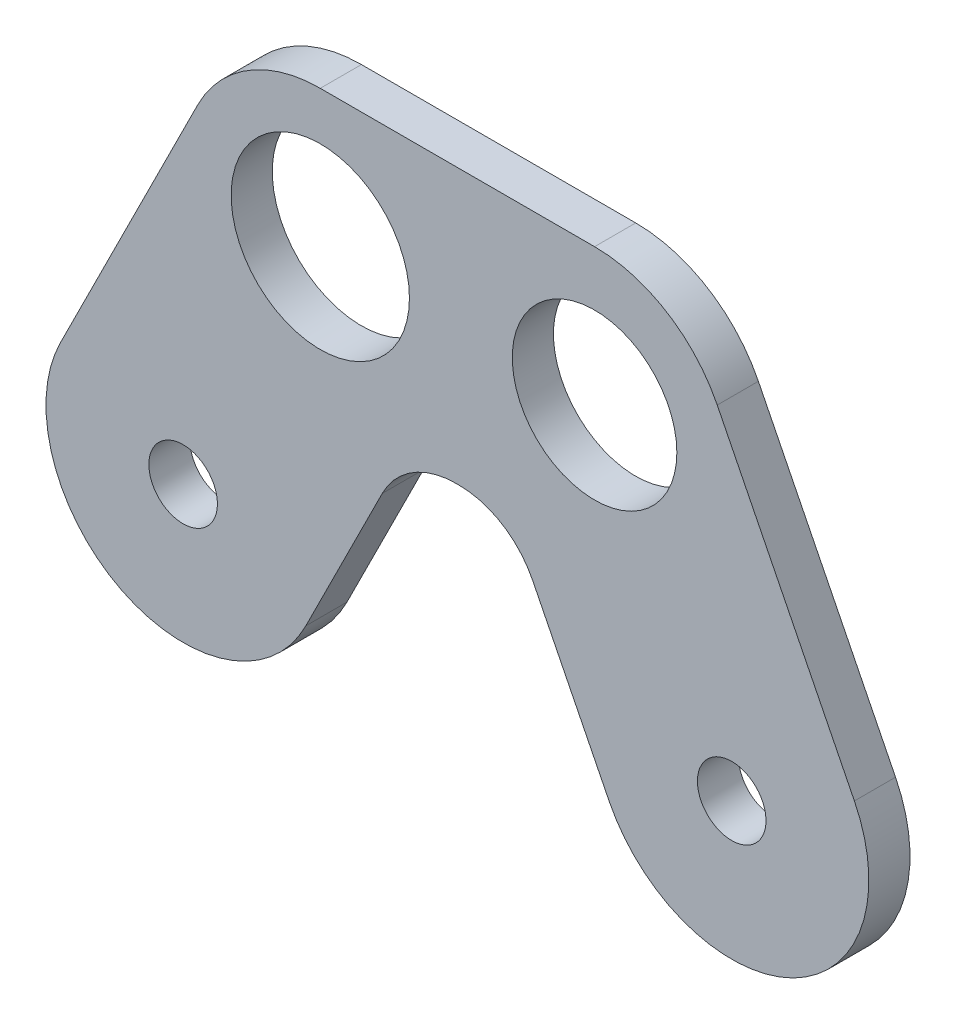
ISO-10303-21;
HEADER;
FILE_DESCRIPTION(('STEP AP214'),'2;1');
FILE_NAME('part.step','',(''),(''),'','','');
FILE_SCHEMA(('AUTOMOTIVE_DESIGN { 1 0 10303 214 1 1 1 1 }'));
ENDSEC;
DATA;
#1=APPLICATION_CONTEXT('core data for automotive mechanical design processes');
#2=APPLICATION_PROTOCOL_DEFINITION('international standard','automotive_design',2000,#1);
#3=PRODUCT_CONTEXT('',#1,'mechanical');
#4=PRODUCT('Part','Part','',(#3));
#5=PRODUCT_RELATED_PRODUCT_CATEGORY('part','',(#4));
#6=PRODUCT_DEFINITION_FORMATION('','',#4);
#7=PRODUCT_DEFINITION_CONTEXT('part definition',#1,'design');
#8=PRODUCT_DEFINITION('design','',#6,#7);
#9=PRODUCT_DEFINITION_SHAPE('','',#8);
#10=(LENGTH_UNIT() NAMED_UNIT(*) SI_UNIT(.MILLI.,.METRE.));
#11=(NAMED_UNIT(*) PLANE_ANGLE_UNIT() SI_UNIT($,.RADIAN.));
#12=(NAMED_UNIT(*) SI_UNIT($,.STERADIAN.) SOLID_ANGLE_UNIT());
#13=UNCERTAINTY_MEASURE_WITH_UNIT(LENGTH_MEASURE(1.E-05),#10,'distance_accuracy_value','');
#14=(GEOMETRIC_REPRESENTATION_CONTEXT(3) GLOBAL_UNCERTAINTY_ASSIGNED_CONTEXT((#13)) GLOBAL_UNIT_ASSIGNED_CONTEXT((#10,
#11,#12)) REPRESENTATION_CONTEXT('',''));
#15=CARTESIAN_POINT('',(0.,0.,0.));
#16=DIRECTION('',(0.,0.,1.));
#17=DIRECTION('',(1.,0.,0.));
#18=AXIS2_PLACEMENT_3D('',#15,#16,#17);
#19=CARTESIAN_POINT('',(30.,-20.,3.));
#20=DIRECTION('',(0.,0.,1.));
#21=DIRECTION('',(1.,0.,0.));
#22=AXIS2_PLACEMENT_3D('',#19,#20,#21);
#23=PLANE('',#22);
#24=CARTESIAN_POINT('',(-10.,-20.,3.));
#25=DIRECTION('',(0.,0.,1.));
#26=DIRECTION('',(1.,0.,0.));
#27=AXIS2_PLACEMENT_3D('',#24,#25,#26);
#28=CIRCLE('',#27,2.5);
#29=CARTESIAN_POINT('',(-7.5,-20.,3.));
#30=VERTEX_POINT('',#29);
#31=EDGE_CURVE('E433',#30,#30,#28,.T.);
#32=ORIENTED_EDGE('',*,*,#31,.F.);
#33=EDGE_LOOP('',(#32));
#34=FACE_BOUND('',#33,.T.);
#35=CARTESIAN_POINT('',(0.,0.,3.));
#36=DIRECTION('',(0.,0.,1.));
#37=DIRECTION('',(1.,0.,0.));
#38=AXIS2_PLACEMENT_3D('',#35,#36,#37);
#39=CIRCLE('',#38,6.5);
#40=CARTESIAN_POINT('',(6.5,0.,3.));
#41=VERTEX_POINT('',#40);
#42=EDGE_CURVE('E187',#41,#41,#39,.T.);
#43=ORIENTED_EDGE('',*,*,#42,.F.);
#44=EDGE_LOOP('',(#43));
#45=FACE_BOUND('',#44,.T.);
#46=DIRECTION('',(0.447213595499958,0.894427190999916,0.));
#47=VECTOR('',#46,1.);
#48=CARTESIAN_POINT('',(-1.05572809000083,-24.4721359549996,3.));
#49=LINE('',#48,#47);
#50=CARTESIAN_POINT('',(-1.05572809000083,-24.4721359549996,3.));
#51=VERTEX_POINT('',#50);
#52=CARTESIAN_POINT('',(4.52198067399882,-13.3167184270003,3.));
#53=VERTEX_POINT('',#52);
#54=EDGE_CURVE('E179',#51,#53,#49,.T.);
#55=ORIENTED_EDGE('',*,*,#54,.T.);
#56=CARTESIAN_POINT('',(9.88854381999832,-16.,3.));
#57=DIRECTION('',(0.,0.,1.));
#58=DIRECTION('',(1.,0.,0.));
#59=AXIS2_PLACEMENT_3D('',#56,#57,#58);
#60=CIRCLE('',#59,6.);
#61=CARTESIAN_POINT('',(9.88854381999831,-10.,3.));
#62=VERTEX_POINT('',#61);
#63=EDGE_CURVE('E11',#53,#62,#60,.F.);
#64=ORIENTED_EDGE('',*,*,#63,.T.);
#65=DIRECTION('',(1.,0.,0.));
#66=VECTOR('',#65,1.);
#67=CARTESIAN_POINT('',(6.18033988749895,-10.,3.));
#68=LINE('',#67,#66);
#69=CARTESIAN_POINT('',(10.1114561800017,-10.,3.));
#70=VERTEX_POINT('',#69);
#71=EDGE_CURVE('E141',#62,#70,#68,.T.);
#72=ORIENTED_EDGE('',*,*,#71,.T.);
#73=CARTESIAN_POINT('',(10.1114561800017,-16.,3.));
#74=DIRECTION('',(0.,0.,1.));
#75=DIRECTION('',(1.,0.,0.));
#76=AXIS2_PLACEMENT_3D('',#73,#74,#75);
#77=CIRCLE('',#76,6.);
#78=CARTESIAN_POINT('',(15.4780193260012,-13.3167184270003,3.));
#79=VERTEX_POINT('',#78);
#80=EDGE_CURVE('E136',#70,#79,#77,.F.);
#81=ORIENTED_EDGE('',*,*,#80,.T.);
#82=DIRECTION('',(0.447213595499958,-0.894427190999916,0.));
#83=VECTOR('',#82,1.);
#84=CARTESIAN_POINT('',(21.0557280900008,-24.4721359549996,3.));
#85=LINE('',#84,#83);
#86=CARTESIAN_POINT('',(21.0557280900008,-24.4721359549996,3.));
#87=VERTEX_POINT('',#86);
#88=EDGE_CURVE('E128',#79,#87,#85,.T.);
#89=ORIENTED_EDGE('',*,*,#88,.T.);
#90=CARTESIAN_POINT('',(30.,-20.,3.));
#91=DIRECTION('',(0.,0.,1.));
#92=DIRECTION('',(1.,0.,0.));
#93=AXIS2_PLACEMENT_3D('',#90,#91,#92);
#94=CIRCLE('',#93,10.);
#95=CARTESIAN_POINT('',(38.9442719099992,-15.5278640450004,3.));
#96=VERTEX_POINT('',#95);
#97=EDGE_CURVE('E132',#87,#96,#94,.T.);
#98=ORIENTED_EDGE('',*,*,#97,.T.);
#99=DIRECTION('',(-0.447213595499958,0.894427190999916,0.));
#100=VECTOR('',#99,1.);
#101=CARTESIAN_POINT('',(28.9442719099992,4.47213595499958,3.));
#102=LINE('',#101,#100);
#103=CARTESIAN_POINT('',(28.9442719099992,4.47213595499958,3.));
#104=VERTEX_POINT('',#103);
#105=EDGE_CURVE('E158',#96,#104,#102,.T.);
#106=ORIENTED_EDGE('',*,*,#105,.T.);
#107=CARTESIAN_POINT('',(20.,0.,3.));
#108=DIRECTION('',(0.,0.,1.));
#109=DIRECTION('',(1.,0.,0.));
#110=AXIS2_PLACEMENT_3D('',#107,#108,#109);
#111=CIRCLE('',#110,10.);
#112=CARTESIAN_POINT('',(20.,10.,3.));
#113=VERTEX_POINT('',#112);
#114=EDGE_CURVE('E161',#104,#113,#111,.T.);
#115=ORIENTED_EDGE('',*,*,#114,.T.);
#116=DIRECTION('',(-1.,0.,0.));
#117=VECTOR('',#116,1.);
#118=CARTESIAN_POINT('',(0.,10.,3.));
#119=LINE('',#118,#117);
#120=CARTESIAN_POINT('',(0.,10.,3.));
#121=VERTEX_POINT('',#120);
#122=EDGE_CURVE('E167',#113,#121,#119,.T.);
#123=ORIENTED_EDGE('',*,*,#122,.T.);
#124=CARTESIAN_POINT('',(0.,0.,3.));
#125=DIRECTION('',(0.,0.,1.));
#126=DIRECTION('',(1.,0.,0.));
#127=AXIS2_PLACEMENT_3D('',#124,#125,#126);
#128=CIRCLE('',#127,10.);
#129=CARTESIAN_POINT('',(-8.94427190999916,4.47213595499958,3.));
#130=VERTEX_POINT('',#129);
#131=EDGE_CURVE('E170',#121,#130,#128,.T.);
#132=ORIENTED_EDGE('',*,*,#131,.T.);
#133=DIRECTION('',(-0.447213595499958,-0.894427190999916,0.));
#134=VECTOR('',#133,1.);
#135=CARTESIAN_POINT('',(-18.9442719099992,-15.5278640450004,3.));
#136=LINE('',#135,#134);
#137=CARTESIAN_POINT('',(-18.9442719099992,-15.5278640450004,3.));
#138=VERTEX_POINT('',#137);
#139=EDGE_CURVE('E173',#130,#138,#136,.T.);
#140=ORIENTED_EDGE('',*,*,#139,.T.);
#141=CARTESIAN_POINT('',(-10.,-20.,3.));
#142=DIRECTION('',(0.,0.,1.));
#143=DIRECTION('',(1.,0.,0.));
#144=AXIS2_PLACEMENT_3D('',#141,#142,#143);
#145=CIRCLE('',#144,10.);
#146=EDGE_CURVE('E176',#138,#51,#145,.T.);
#147=ORIENTED_EDGE('',*,*,#146,.T.);
#148=EDGE_LOOP('',(#55,#64,#72,#81,#89,#98,#106,#115,#123,#132,#140,#147));
#149=FACE_BOUND('',#148,.T.);
#150=CARTESIAN_POINT('',(20.,0.,3.));
#151=DIRECTION('',(0.,0.,1.));
#152=DIRECTION('',(1.,0.,0.));
#153=AXIS2_PLACEMENT_3D('',#150,#151,#152);
#154=CIRCLE('',#153,6.);
#155=CARTESIAN_POINT('',(26.,0.,3.));
#156=VERTEX_POINT('',#155);
#157=EDGE_CURVE('E450',#156,#156,#154,.T.);
#158=ORIENTED_EDGE('',*,*,#157,.F.);
#159=EDGE_LOOP('',(#158));
#160=FACE_BOUND('',#159,.T.);
#161=CARTESIAN_POINT('',(30.,-20.,3.));
#162=DIRECTION('',(0.,0.,1.));
#163=DIRECTION('',(-1.,0.,0.));
#164=AXIS2_PLACEMENT_3D('',#161,#162,#163);
#165=CIRCLE('',#164,2.5);
#166=CARTESIAN_POINT('',(27.5,-20.,3.));
#167=VERTEX_POINT('',#166);
#168=EDGE_CURVE('E439',#167,#167,#165,.T.);
#169=ORIENTED_EDGE('',*,*,#168,.F.);
#170=EDGE_LOOP('',(#169));
#171=FACE_BOUND('',#170,.T.);
#172=ADVANCED_FACE('F39',(#34,#45,#149,#160,#171),#23,.T.);
#173=CARTESIAN_POINT('',(30.,-20.,0.));
#174=DIRECTION('',(0.,0.,1.));
#175=DIRECTION('',(1.,0.,0.));
#176=AXIS2_PLACEMENT_3D('',#173,#174,#175);
#177=PLANE('',#176);
#178=DIRECTION('',(1.,0.,0.));
#179=VECTOR('',#178,1.);
#180=CARTESIAN_POINT('',(6.18033988749895,-10.,0.));
#181=LINE('',#180,#179);
#182=CARTESIAN_POINT('',(9.88854381999831,-10.,0.));
#183=VERTEX_POINT('',#182);
#184=CARTESIAN_POINT('',(10.1114561800017,-10.,0.));
#185=VERTEX_POINT('',#184);
#186=EDGE_CURVE('E183',#183,#185,#181,.T.);
#187=ORIENTED_EDGE('',*,*,#186,.F.);
#188=CARTESIAN_POINT('',(9.88854381999832,-16.,0.));
#189=DIRECTION('',(0.,0.,1.));
#190=DIRECTION('',(1.,0.,0.));
#191=AXIS2_PLACEMENT_3D('',#188,#189,#190);
#192=CIRCLE('',#191,6.);
#193=CARTESIAN_POINT('',(4.52198067399882,-13.3167184270003,0.));
#194=VERTEX_POINT('',#193);
#195=EDGE_CURVE('E48',#183,#194,#192,.T.);
#196=ORIENTED_EDGE('',*,*,#195,.T.);
#197=DIRECTION('',(0.447213595499958,0.894427190999916,0.));
#198=VECTOR('',#197,1.);
#199=CARTESIAN_POINT('',(-1.05572809000083,-24.4721359549996,0.));
#200=LINE('',#199,#198);
#201=CARTESIAN_POINT('',(-1.05572809000083,-24.4721359549996,0.));
#202=VERTEX_POINT('',#201);
#203=EDGE_CURVE('E211',#202,#194,#200,.T.);
#204=ORIENTED_EDGE('',*,*,#203,.F.);
#205=CARTESIAN_POINT('',(-10.,-20.,0.));
#206=DIRECTION('',(0.,0.,1.));
#207=DIRECTION('',(1.,0.,0.));
#208=AXIS2_PLACEMENT_3D('',#205,#206,#207);
#209=CIRCLE('',#208,10.);
#210=CARTESIAN_POINT('',(-18.9442719099992,-15.5278640450004,0.));
#211=VERTEX_POINT('',#210);
#212=EDGE_CURVE('E208',#211,#202,#209,.T.);
#213=ORIENTED_EDGE('',*,*,#212,.F.);
#214=DIRECTION('',(-0.447213595499958,-0.894427190999916,0.));
#215=VECTOR('',#214,1.);
#216=CARTESIAN_POINT('',(-18.9442719099992,-15.5278640450004,0.));
#217=LINE('',#216,#215);
#218=CARTESIAN_POINT('',(-8.94427190999916,4.47213595499958,0.));
#219=VERTEX_POINT('',#218);
#220=EDGE_CURVE('E205',#219,#211,#217,.T.);
#221=ORIENTED_EDGE('',*,*,#220,.F.);
#222=CARTESIAN_POINT('',(0.,0.,0.));
#223=DIRECTION('',(0.,0.,1.));
#224=DIRECTION('',(1.,0.,0.));
#225=AXIS2_PLACEMENT_3D('',#222,#223,#224);
#226=CIRCLE('',#225,10.);
#227=CARTESIAN_POINT('',(0.,10.,0.));
#228=VERTEX_POINT('',#227);
#229=EDGE_CURVE('E202',#228,#219,#226,.T.);
#230=ORIENTED_EDGE('',*,*,#229,.F.);
#231=DIRECTION('',(-1.,0.,0.));
#232=VECTOR('',#231,1.);
#233=CARTESIAN_POINT('',(0.,10.,0.));
#234=LINE('',#233,#232);
#235=CARTESIAN_POINT('',(20.,10.,0.));
#236=VERTEX_POINT('',#235);
#237=EDGE_CURVE('E199',#236,#228,#234,.T.);
#238=ORIENTED_EDGE('',*,*,#237,.F.);
#239=CARTESIAN_POINT('',(20.,0.,0.));
#240=DIRECTION('',(0.,0.,1.));
#241=DIRECTION('',(1.,0.,0.));
#242=AXIS2_PLACEMENT_3D('',#239,#240,#241);
#243=CIRCLE('',#242,10.);
#244=CARTESIAN_POINT('',(28.9442719099992,4.47213595499958,0.));
#245=VERTEX_POINT('',#244);
#246=EDGE_CURVE('E196',#245,#236,#243,.T.);
#247=ORIENTED_EDGE('',*,*,#246,.F.);
#248=DIRECTION('',(-0.447213595499958,0.894427190999916,0.));
#249=VECTOR('',#248,1.);
#250=CARTESIAN_POINT('',(28.9442719099992,4.47213595499958,0.));
#251=LINE('',#250,#249);
#252=CARTESIAN_POINT('',(38.9442719099992,-15.5278640450004,0.));
#253=VERTEX_POINT('',#252);
#254=EDGE_CURVE('E193',#253,#245,#251,.T.);
#255=ORIENTED_EDGE('',*,*,#254,.F.);
#256=CARTESIAN_POINT('',(30.,-20.,0.));
#257=DIRECTION('',(0.,0.,1.));
#258=DIRECTION('',(1.,0.,0.));
#259=AXIS2_PLACEMENT_3D('',#256,#257,#258);
#260=CIRCLE('',#259,10.);
#261=CARTESIAN_POINT('',(21.0557280900008,-24.4721359549996,0.));
#262=VERTEX_POINT('',#261);
#263=EDGE_CURVE('E190',#262,#253,#260,.T.);
#264=ORIENTED_EDGE('',*,*,#263,.F.);
#265=DIRECTION('',(0.447213595499958,-0.894427190999916,0.));
#266=VECTOR('',#265,1.);
#267=CARTESIAN_POINT('',(21.0557280900008,-24.4721359549996,0.));
#268=LINE('',#267,#266);
#269=CARTESIAN_POINT('',(15.4780193260012,-13.3167184270003,0.));
#270=VERTEX_POINT('',#269);
#271=EDGE_CURVE('E147',#270,#262,#268,.T.);
#272=ORIENTED_EDGE('',*,*,#271,.F.);
#273=CARTESIAN_POINT('',(10.1114561800017,-16.,0.));
#274=DIRECTION('',(0.,0.,1.));
#275=DIRECTION('',(1.,0.,0.));
#276=AXIS2_PLACEMENT_3D('',#273,#274,#275);
#277=CIRCLE('',#276,6.);
#278=EDGE_CURVE('E250',#270,#185,#277,.T.);
#279=ORIENTED_EDGE('',*,*,#278,.T.);
#280=EDGE_LOOP('',(#187,#196,#204,#213,#221,#230,#238,#247,#255,#264,#272,#279));
#281=FACE_BOUND('',#280,.T.);
#282=CARTESIAN_POINT('',(0.,0.,0.));
#283=DIRECTION('',(0.,0.,1.));
#284=DIRECTION('',(1.,0.,0.));
#285=AXIS2_PLACEMENT_3D('',#282,#283,#284);
#286=CIRCLE('',#285,6.5);
#287=CARTESIAN_POINT('',(6.5,0.,0.));
#288=VERTEX_POINT('',#287);
#289=EDGE_CURVE('E454',#288,#288,#286,.T.);
#290=ORIENTED_EDGE('',*,*,#289,.T.);
#291=EDGE_LOOP('',(#290));
#292=FACE_BOUND('',#291,.T.);
#293=CARTESIAN_POINT('',(20.,0.,0.));
#294=DIRECTION('',(0.,0.,1.));
#295=DIRECTION('',(1.,0.,0.));
#296=AXIS2_PLACEMENT_3D('',#293,#294,#295);
#297=CIRCLE('',#296,6.);
#298=CARTESIAN_POINT('',(26.,0.,0.));
#299=VERTEX_POINT('',#298);
#300=EDGE_CURVE('E443',#299,#299,#297,.T.);
#301=ORIENTED_EDGE('',*,*,#300,.T.);
#302=EDGE_LOOP('',(#301));
#303=FACE_BOUND('',#302,.T.);
#304=CARTESIAN_POINT('',(-10.,-20.,0.));
#305=DIRECTION('',(0.,0.,1.));
#306=DIRECTION('',(1.,0.,0.));
#307=AXIS2_PLACEMENT_3D('',#304,#305,#306);
#308=CIRCLE('',#307,2.5);
#309=CARTESIAN_POINT('',(-7.5,-20.,0.));
#310=VERTEX_POINT('',#309);
#311=EDGE_CURVE('E436',#310,#310,#308,.T.);
#312=ORIENTED_EDGE('',*,*,#311,.T.);
#313=EDGE_LOOP('',(#312));
#314=FACE_BOUND('',#313,.T.);
#315=CARTESIAN_POINT('',(30.,-20.,0.));
#316=DIRECTION('',(0.,0.,1.));
#317=DIRECTION('',(-1.,0.,0.));
#318=AXIS2_PLACEMENT_3D('',#315,#316,#317);
#319=CIRCLE('',#318,2.5);
#320=CARTESIAN_POINT('',(27.5,-20.,0.));
#321=VERTEX_POINT('',#320);
#322=EDGE_CURVE('E446',#321,#321,#319,.T.);
#323=ORIENTED_EDGE('',*,*,#322,.T.);
#324=EDGE_LOOP('',(#323));
#325=FACE_BOUND('',#324,.T.);
#326=ADVANCED_FACE('F255',(#281,#292,#303,#314,#325),#177,.F.);
#327=CARTESIAN_POINT('',(6.18033988749895,-10.,3.));
#328=DIRECTION('',(0.,1.,0.));
#329=DIRECTION('',(-1.,0.,0.));
#330=AXIS2_PLACEMENT_3D('',#327,#328,#329);
#331=PLANE('',#330);
#332=ORIENTED_EDGE('',*,*,#186,.T.);
#333=DIRECTION('',(0.,0.,-1.));
#334=VECTOR('',#333,1.);
#335=CARTESIAN_POINT('',(10.1114561800017,-10.,3.));
#336=LINE('',#335,#334);
#337=EDGE_CURVE('E245',#185,#70,#336,.F.);
#338=ORIENTED_EDGE('',*,*,#337,.T.);
#339=ORIENTED_EDGE('',*,*,#71,.F.);
#340=DIRECTION('',(0.,0.,-1.));
#341=VECTOR('',#340,1.);
#342=CARTESIAN_POINT('',(9.88854381999831,-10.,0.));
#343=LINE('',#342,#341);
#344=EDGE_CURVE('E241',#62,#183,#343,.T.);
#345=ORIENTED_EDGE('',*,*,#344,.T.);
#346=EDGE_LOOP('',(#332,#338,#339,#345));
#347=FACE_BOUND('',#346,.T.);
#348=ADVANCED_FACE('F260',(#347),#331,.F.);
#349=CARTESIAN_POINT('',(21.0557280900008,-24.4721359549996,3.));
#350=DIRECTION('',(0.894427190999916,0.447213595499958,0.));
#351=DIRECTION('',(-0.447213595499958,0.894427190999916,0.));
#352=AXIS2_PLACEMENT_3D('',#349,#350,#351);
#353=PLANE('',#352);
#354=ORIENTED_EDGE('',*,*,#88,.F.);
#355=DIRECTION('',(0.,0.,-1.));
#356=VECTOR('',#355,1.);
#357=CARTESIAN_POINT('',(15.4780193260012,-13.3167184270003,0.));
#358=LINE('',#357,#356);
#359=EDGE_CURVE('E151',#79,#270,#358,.T.);
#360=ORIENTED_EDGE('',*,*,#359,.T.);
#361=ORIENTED_EDGE('',*,*,#271,.T.);
#362=DIRECTION('',(0.,0.,-1.));
#363=VECTOR('',#362,1.);
#364=CARTESIAN_POINT('',(21.0557280900008,-24.4721359549996,3.));
#365=LINE('',#364,#363);
#366=EDGE_CURVE('E144',#87,#262,#365,.T.);
#367=ORIENTED_EDGE('',*,*,#366,.F.);
#368=EDGE_LOOP('',(#354,#360,#361,#367));
#369=FACE_BOUND('',#368,.T.);
#370=ADVANCED_FACE('F145',(#369),#353,.F.);
#371=CARTESIAN_POINT('',(30.,-20.,3.));
#372=DIRECTION('',(0.,0.,-1.));
#373=DIRECTION('',(-1.,0.,0.));
#374=AXIS2_PLACEMENT_3D('',#371,#372,#373);
#375=CYLINDRICAL_SURFACE('',#374,10.);
#376=ORIENTED_EDGE('',*,*,#263,.T.);
#377=DIRECTION('',(0.,0.,-1.));
#378=VECTOR('',#377,1.);
#379=CARTESIAN_POINT('',(38.9442719099992,-15.5278640450004,3.));
#380=LINE('',#379,#378);
#381=EDGE_CURVE('E152',#96,#253,#380,.T.);
#382=ORIENTED_EDGE('',*,*,#381,.F.);
#383=ORIENTED_EDGE('',*,*,#97,.F.);
#384=ORIENTED_EDGE('',*,*,#366,.T.);
#385=EDGE_LOOP('',(#376,#382,#383,#384));
#386=FACE_BOUND('',#385,.T.);
#387=ADVANCED_FACE('F154',(#386),#375,.T.);
#388=CARTESIAN_POINT('',(28.9442719099992,4.47213595499958,3.));
#389=DIRECTION('',(-0.894427190999916,-0.447213595499958,0.));
#390=DIRECTION('',(0.447213595499958,-0.894427190999916,0.));
#391=AXIS2_PLACEMENT_3D('',#388,#389,#390);
#392=PLANE('',#391);
#393=ORIENTED_EDGE('',*,*,#254,.T.);
#394=DIRECTION('',(0.,0.,-1.));
#395=VECTOR('',#394,1.);
#396=CARTESIAN_POINT('',(28.9442719099992,4.47213595499958,3.));
#397=LINE('',#396,#395);
#398=EDGE_CURVE('E233',#104,#245,#397,.T.);
#399=ORIENTED_EDGE('',*,*,#398,.F.);
#400=ORIENTED_EDGE('',*,*,#105,.F.);
#401=ORIENTED_EDGE('',*,*,#381,.T.);
#402=EDGE_LOOP('',(#393,#399,#400,#401));
#403=FACE_BOUND('',#402,.T.);
#404=ADVANCED_FACE('F310',(#403),#392,.F.);
#405=CARTESIAN_POINT('',(20.,0.,3.));
#406=DIRECTION('',(0.,0.,-1.));
#407=DIRECTION('',(-1.,0.,0.));
#408=AXIS2_PLACEMENT_3D('',#405,#406,#407);
#409=CYLINDRICAL_SURFACE('',#408,10.);
#410=ORIENTED_EDGE('',*,*,#246,.T.);
#411=DIRECTION('',(0.,0.,-1.));
#412=VECTOR('',#411,1.);
#413=CARTESIAN_POINT('',(20.,10.,3.));
#414=LINE('',#413,#412);
#415=EDGE_CURVE('E229',#113,#236,#414,.T.);
#416=ORIENTED_EDGE('',*,*,#415,.F.);
#417=ORIENTED_EDGE('',*,*,#114,.F.);
#418=ORIENTED_EDGE('',*,*,#398,.T.);
#419=EDGE_LOOP('',(#410,#416,#417,#418));
#420=FACE_BOUND('',#419,.T.);
#421=ADVANCED_FACE('F306',(#420),#409,.T.);
#422=CARTESIAN_POINT('',(0.,10.,3.));
#423=DIRECTION('',(0.,-1.,0.));
#424=DIRECTION('',(0.,0.,-1.));
#425=AXIS2_PLACEMENT_3D('',#422,#423,#424);
#426=PLANE('',#425);
#427=ORIENTED_EDGE('',*,*,#237,.T.);
#428=DIRECTION('',(0.,0.,-1.));
#429=VECTOR('',#428,1.);
#430=CARTESIAN_POINT('',(0.,10.,3.));
#431=LINE('',#430,#429);
#432=EDGE_CURVE('E225',#121,#228,#431,.T.);
#433=ORIENTED_EDGE('',*,*,#432,.F.);
#434=ORIENTED_EDGE('',*,*,#122,.F.);
#435=ORIENTED_EDGE('',*,*,#415,.T.);
#436=EDGE_LOOP('',(#427,#433,#434,#435));
#437=FACE_BOUND('',#436,.T.);
#438=ADVANCED_FACE('F302',(#437),#426,.F.);
#439=CARTESIAN_POINT('',(0.,0.,3.));
#440=DIRECTION('',(0.,0.,-1.));
#441=DIRECTION('',(-1.,0.,0.));
#442=AXIS2_PLACEMENT_3D('',#439,#440,#441);
#443=CYLINDRICAL_SURFACE('',#442,10.);
#444=ORIENTED_EDGE('',*,*,#229,.T.);
#445=DIRECTION('',(0.,0.,-1.));
#446=VECTOR('',#445,1.);
#447=CARTESIAN_POINT('',(-8.94427190999916,4.47213595499958,3.));
#448=LINE('',#447,#446);
#449=EDGE_CURVE('E221',#130,#219,#448,.T.);
#450=ORIENTED_EDGE('',*,*,#449,.F.);
#451=ORIENTED_EDGE('',*,*,#131,.F.);
#452=ORIENTED_EDGE('',*,*,#432,.T.);
#453=EDGE_LOOP('',(#444,#450,#451,#452));
#454=FACE_BOUND('',#453,.T.);
#455=ADVANCED_FACE('F298',(#454),#443,.T.);
#456=CARTESIAN_POINT('',(-18.9442719099992,-15.5278640450004,3.));
#457=DIRECTION('',(0.894427190999916,-0.447213595499958,0.));
#458=DIRECTION('',(0.447213595499958,0.894427190999916,0.));
#459=AXIS2_PLACEMENT_3D('',#456,#457,#458);
#460=PLANE('',#459);
#461=ORIENTED_EDGE('',*,*,#220,.T.);
#462=DIRECTION('',(0.,0.,-1.));
#463=VECTOR('',#462,1.);
#464=CARTESIAN_POINT('',(-18.9442719099992,-15.5278640450004,3.));
#465=LINE('',#464,#463);
#466=EDGE_CURVE('E217',#138,#211,#465,.T.);
#467=ORIENTED_EDGE('',*,*,#466,.F.);
#468=ORIENTED_EDGE('',*,*,#139,.F.);
#469=ORIENTED_EDGE('',*,*,#449,.T.);
#470=EDGE_LOOP('',(#461,#467,#468,#469));
#471=FACE_BOUND('',#470,.T.);
#472=ADVANCED_FACE('F294',(#471),#460,.F.);
#473=CARTESIAN_POINT('',(-10.,-20.,3.));
#474=DIRECTION('',(0.,0.,-1.));
#475=DIRECTION('',(-1.,0.,0.));
#476=AXIS2_PLACEMENT_3D('',#473,#474,#475);
#477=CYLINDRICAL_SURFACE('',#476,10.);
#478=ORIENTED_EDGE('',*,*,#212,.T.);
#479=DIRECTION('',(0.,0.,-1.));
#480=VECTOR('',#479,1.);
#481=CARTESIAN_POINT('',(-1.05572809000083,-24.4721359549996,3.));
#482=LINE('',#481,#480);
#483=EDGE_CURVE('E182',#51,#202,#482,.T.);
#484=ORIENTED_EDGE('',*,*,#483,.F.);
#485=ORIENTED_EDGE('',*,*,#146,.F.);
#486=ORIENTED_EDGE('',*,*,#466,.T.);
#487=EDGE_LOOP('',(#478,#484,#485,#486));
#488=FACE_BOUND('',#487,.T.);
#489=ADVANCED_FACE('F291',(#488),#477,.T.);
#490=CARTESIAN_POINT('',(-1.05572809000083,-24.4721359549996,3.));
#491=DIRECTION('',(-0.894427190999916,0.447213595499958,0.));
#492=DIRECTION('',(-0.447213595499958,-0.894427190999916,0.));
#493=AXIS2_PLACEMENT_3D('',#490,#491,#492);
#494=PLANE('',#493);
#495=ORIENTED_EDGE('',*,*,#203,.T.);
#496=DIRECTION('',(0.,0.,-1.));
#497=VECTOR('',#496,1.);
#498=CARTESIAN_POINT('',(4.52198067399882,-13.3167184270003,3.));
#499=LINE('',#498,#497);
#500=EDGE_CURVE('E55',#194,#53,#499,.F.);
#501=ORIENTED_EDGE('',*,*,#500,.T.);
#502=ORIENTED_EDGE('',*,*,#54,.F.);
#503=ORIENTED_EDGE('',*,*,#483,.T.);
#504=EDGE_LOOP('',(#495,#501,#502,#503));
#505=FACE_BOUND('',#504,.T.);
#506=ADVANCED_FACE('F288',(#505),#494,.F.);
#507=CARTESIAN_POINT('',(0.,0.,3.));
#508=DIRECTION('',(0.,0.,-1.));
#509=DIRECTION('',(-1.,0.,0.));
#510=AXIS2_PLACEMENT_3D('',#507,#508,#509);
#511=CYLINDRICAL_SURFACE('',#510,6.5);
#512=ORIENTED_EDGE('',*,*,#42,.T.);
#513=EDGE_LOOP('',(#512));
#514=FACE_BOUND('',#513,.T.);
#515=ORIENTED_EDGE('',*,*,#289,.F.);
#516=EDGE_LOOP('',(#515));
#517=FACE_BOUND('',#516,.T.);
#518=ADVANCED_FACE('F285',(#514,#517),#511,.F.);
#519=CARTESIAN_POINT('',(20.,0.,3.));
#520=DIRECTION('',(0.,0.,-1.));
#521=DIRECTION('',(-1.,0.,0.));
#522=AXIS2_PLACEMENT_3D('',#519,#520,#521);
#523=CYLINDRICAL_SURFACE('',#522,6.);
#524=ORIENTED_EDGE('',*,*,#157,.T.);
#525=EDGE_LOOP('',(#524));
#526=FACE_BOUND('',#525,.T.);
#527=ORIENTED_EDGE('',*,*,#300,.F.);
#528=EDGE_LOOP('',(#527));
#529=FACE_BOUND('',#528,.T.);
#530=ADVANCED_FACE('F365',(#526,#529),#523,.F.);
#531=CARTESIAN_POINT('',(-10.,-20.,3.));
#532=DIRECTION('',(0.,0.,-1.));
#533=DIRECTION('',(-1.,0.,0.));
#534=AXIS2_PLACEMENT_3D('',#531,#532,#533);
#535=CYLINDRICAL_SURFACE('',#534,2.5);
#536=ORIENTED_EDGE('',*,*,#31,.T.);
#537=EDGE_LOOP('',(#536));
#538=FACE_BOUND('',#537,.T.);
#539=ORIENTED_EDGE('',*,*,#311,.F.);
#540=EDGE_LOOP('',(#539));
#541=FACE_BOUND('',#540,.T.);
#542=ADVANCED_FACE('F271',(#538,#541),#535,.F.);
#543=CARTESIAN_POINT('',(30.,-20.,3.));
#544=DIRECTION('',(0.,0.,-1.));
#545=DIRECTION('',(-1.,0.,0.));
#546=AXIS2_PLACEMENT_3D('',#543,#544,#545);
#547=CYLINDRICAL_SURFACE('',#546,2.5);
#548=ORIENTED_EDGE('',*,*,#168,.T.);
#549=EDGE_LOOP('',(#548));
#550=FACE_BOUND('',#549,.T.);
#551=ORIENTED_EDGE('',*,*,#322,.F.);
#552=EDGE_LOOP('',(#551));
#553=FACE_BOUND('',#552,.T.);
#554=ADVANCED_FACE('F265',(#550,#553),#547,.F.);
#555=CARTESIAN_POINT('',(10.1114561800017,-16.,3.));
#556=DIRECTION('',(0.,0.,1.));
#557=DIRECTION('',(1.,0.,0.));
#558=AXIS2_PLACEMENT_3D('',#555,#556,#557);
#559=CYLINDRICAL_SURFACE('',#558,6.);
#560=ORIENTED_EDGE('',*,*,#80,.F.);
#561=ORIENTED_EDGE('',*,*,#337,.F.);
#562=ORIENTED_EDGE('',*,*,#278,.F.);
#563=ORIENTED_EDGE('',*,*,#359,.F.);
#564=EDGE_LOOP('',(#560,#561,#562,#563));
#565=FACE_BOUND('',#564,.T.);
#566=ADVANCED_FACE('F263',(#565),#559,.F.);
#567=CARTESIAN_POINT('',(9.88854381999832,-16.,3.));
#568=DIRECTION('',(0.,0.,1.));
#569=DIRECTION('',(1.,0.,0.));
#570=AXIS2_PLACEMENT_3D('',#567,#568,#569);
#571=CYLINDRICAL_SURFACE('',#570,6.);
#572=ORIENTED_EDGE('',*,*,#63,.F.);
#573=ORIENTED_EDGE('',*,*,#500,.F.);
#574=ORIENTED_EDGE('',*,*,#195,.F.);
#575=ORIENTED_EDGE('',*,*,#344,.F.);
#576=EDGE_LOOP('',(#572,#573,#574,#575));
#577=FACE_BOUND('',#576,.T.);
#578=ADVANCED_FACE('F41',(#577),#571,.F.);
#579=CLOSED_SHELL('',(#172,#326,#348,#370,#387,#404,#421,#438,#455,#472,#489,#506,#518,#530,
#542,#554,#566,#578));
#580=MANIFOLD_SOLID_BREP('B2',#579);
#581=ADVANCED_BREP_SHAPE_REPRESENTATION('',(#18,#580),#14);
#582=SHAPE_DEFINITION_REPRESENTATION(#9,#581);
ENDSEC;
END-ISO-10303-21;
